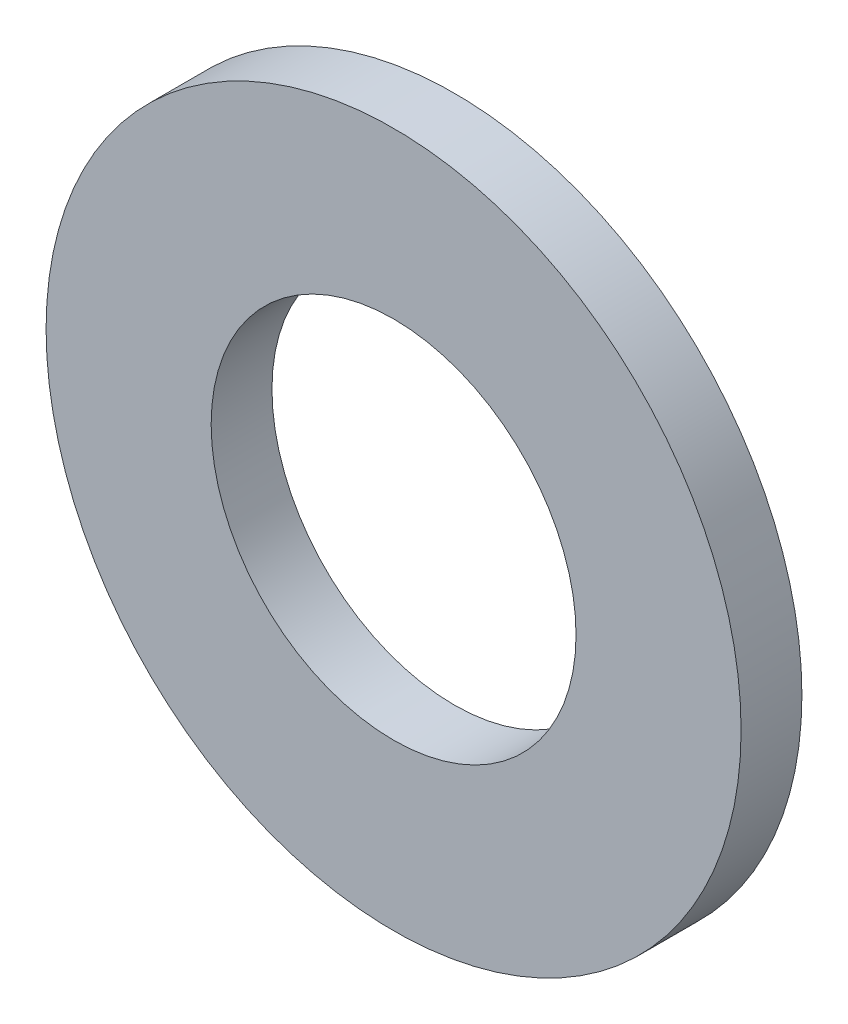
ISO-10303-21;
HEADER;
FILE_DESCRIPTION(('STEP AP214'),'2;1');
FILE_NAME('part.step','',(''),(''),'','','');
FILE_SCHEMA(('AUTOMOTIVE_DESIGN { 1 0 10303 214 1 1 1 1 }'));
ENDSEC;
DATA;
#1=APPLICATION_CONTEXT('core data for automotive mechanical design processes');
#2=APPLICATION_PROTOCOL_DEFINITION('international standard','automotive_design',2000,#1);
#3=PRODUCT_CONTEXT('',#1,'mechanical');
#4=PRODUCT('Part','Part','',(#3));
#5=PRODUCT_RELATED_PRODUCT_CATEGORY('part','',(#4));
#6=PRODUCT_DEFINITION_FORMATION('','',#4);
#7=PRODUCT_DEFINITION_CONTEXT('part definition',#1,'design');
#8=PRODUCT_DEFINITION('design','',#6,#7);
#9=PRODUCT_DEFINITION_SHAPE('','',#8);
#10=(LENGTH_UNIT() NAMED_UNIT(*) SI_UNIT(.MILLI.,.METRE.));
#11=(NAMED_UNIT(*) PLANE_ANGLE_UNIT() SI_UNIT($,.RADIAN.));
#12=(NAMED_UNIT(*) SI_UNIT($,.STERADIAN.) SOLID_ANGLE_UNIT());
#13=UNCERTAINTY_MEASURE_WITH_UNIT(LENGTH_MEASURE(1.E-05),#10,'distance_accuracy_value','');
#14=(GEOMETRIC_REPRESENTATION_CONTEXT(3) GLOBAL_UNCERTAINTY_ASSIGNED_CONTEXT((#13)) GLOBAL_UNIT_ASSIGNED_CONTEXT((#10,
#11,#12)) REPRESENTATION_CONTEXT('',''));
#15=CARTESIAN_POINT('',(0.,0.,0.));
#16=DIRECTION('',(0.,0.,1.));
#17=DIRECTION('',(1.,0.,0.));
#18=AXIS2_PLACEMENT_3D('',#15,#16,#17);
#19=CARTESIAN_POINT('',(0.,0.,-1.4));
#20=DIRECTION('',(0.,0.,1.));
#21=DIRECTION('',(1.,0.,0.));
#22=AXIS2_PLACEMENT_3D('',#19,#20,#21);
#23=CYLINDRICAL_SURFACE('',#22,8.);
#24=CARTESIAN_POINT('',(0.,0.,-1.4));
#25=DIRECTION('',(0.,0.,1.));
#26=DIRECTION('',(1.,0.,0.));
#27=AXIS2_PLACEMENT_3D('',#24,#25,#26);
#28=CIRCLE('',#27,8.);
#29=CARTESIAN_POINT('',(8.,0.,-1.4));
#30=VERTEX_POINT('',#29);
#31=EDGE_CURVE('E10',#30,#30,#28,.T.);
#32=ORIENTED_EDGE('',*,*,#31,.T.);
#33=EDGE_LOOP('',(#32));
#34=FACE_BOUND('',#33,.T.);
#35=CARTESIAN_POINT('',(0.,0.,0.));
#36=DIRECTION('',(0.,0.,1.));
#37=DIRECTION('',(1.,0.,0.));
#38=AXIS2_PLACEMENT_3D('',#35,#36,#37);
#39=CIRCLE('',#38,8.);
#40=CARTESIAN_POINT('',(8.,0.,0.));
#41=VERTEX_POINT('',#40);
#42=EDGE_CURVE('E31',#41,#41,#39,.T.);
#43=ORIENTED_EDGE('',*,*,#42,.F.);
#44=EDGE_LOOP('',(#43));
#45=FACE_BOUND('',#44,.T.);
#46=ADVANCED_FACE('F28',(#34,#45),#23,.T.);
#47=CARTESIAN_POINT('',(0.,0.,-1.4));
#48=DIRECTION('',(0.,0.,1.));
#49=DIRECTION('',(1.,0.,0.));
#50=AXIS2_PLACEMENT_3D('',#47,#48,#49);
#51=PLANE('',#50);
#52=CARTESIAN_POINT('',(0.,0.,-1.4));
#53=DIRECTION('',(0.,0.,1.));
#54=DIRECTION('',(1.,0.,0.));
#55=AXIS2_PLACEMENT_3D('',#52,#53,#54);
#56=CIRCLE('',#55,4.2);
#57=CARTESIAN_POINT('',(4.2,0.,-1.4));
#58=VERTEX_POINT('',#57);
#59=EDGE_CURVE('E38',#58,#58,#56,.T.);
#60=ORIENTED_EDGE('',*,*,#59,.T.);
#61=EDGE_LOOP('',(#60));
#62=FACE_BOUND('',#61,.T.);
#63=ORIENTED_EDGE('',*,*,#31,.F.);
#64=EDGE_LOOP('',(#63));
#65=FACE_BOUND('',#64,.T.);
#66=ADVANCED_FACE('F46',(#62,#65),#51,.F.);
#67=CARTESIAN_POINT('',(0.,0.,0.));
#68=DIRECTION('',(0.,0.,1.));
#69=DIRECTION('',(1.,0.,0.));
#70=AXIS2_PLACEMENT_3D('',#67,#68,#69);
#71=PLANE('',#70);
#72=CARTESIAN_POINT('',(0.,0.,0.));
#73=DIRECTION('',(0.,0.,1.));
#74=DIRECTION('',(1.,0.,0.));
#75=AXIS2_PLACEMENT_3D('',#72,#73,#74);
#76=CIRCLE('',#75,4.2);
#77=CARTESIAN_POINT('',(4.2,0.,0.));
#78=VERTEX_POINT('',#77);
#79=EDGE_CURVE('E40',#78,#78,#76,.T.);
#80=ORIENTED_EDGE('',*,*,#79,.F.);
#81=EDGE_LOOP('',(#80));
#82=FACE_BOUND('',#81,.T.);
#83=ORIENTED_EDGE('',*,*,#42,.T.);
#84=EDGE_LOOP('',(#83));
#85=FACE_BOUND('',#84,.T.);
#86=ADVANCED_FACE('F52',(#82,#85),#71,.T.);
#87=CARTESIAN_POINT('',(0.,0.,-1.4));
#88=DIRECTION('',(0.,0.,1.));
#89=DIRECTION('',(1.,0.,0.));
#90=AXIS2_PLACEMENT_3D('',#87,#88,#89);
#91=CYLINDRICAL_SURFACE('',#90,4.2);
#92=ORIENTED_EDGE('',*,*,#59,.F.);
#93=EDGE_LOOP('',(#92));
#94=FACE_BOUND('',#93,.T.);
#95=ORIENTED_EDGE('',*,*,#79,.T.);
#96=EDGE_LOOP('',(#95));
#97=FACE_BOUND('',#96,.T.);
#98=ADVANCED_FACE('F49',(#94,#97),#91,.F.);
#99=CLOSED_SHELL('',(#46,#66,#86,#98));
#100=MANIFOLD_SOLID_BREP('B2',#99);
#101=ADVANCED_BREP_SHAPE_REPRESENTATION('',(#18,#100),#14);
#102=SHAPE_DEFINITION_REPRESENTATION(#9,#101);
ENDSEC;
END-ISO-10303-21;
